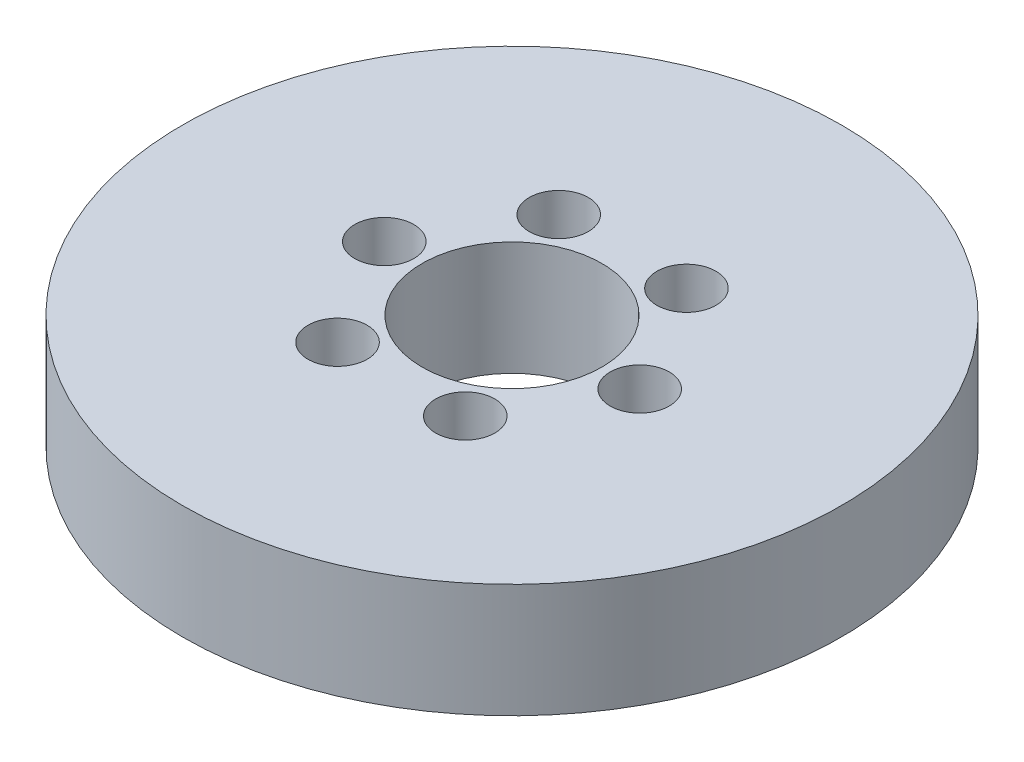
ISO-10303-21;
HEADER;
FILE_DESCRIPTION(('STEP AP214'),'2;1');
FILE_NAME('part.step','',(''),(''),'','','');
FILE_SCHEMA(('AUTOMOTIVE_DESIGN { 1 0 10303 214 1 1 1 1 }'));
ENDSEC;
DATA;
#1=APPLICATION_CONTEXT('core data for automotive mechanical design processes');
#2=APPLICATION_PROTOCOL_DEFINITION('international standard','automotive_design',2000,#1);
#3=PRODUCT_CONTEXT('',#1,'mechanical');
#4=PRODUCT('Part','Part','',(#3));
#5=PRODUCT_RELATED_PRODUCT_CATEGORY('part','',(#4));
#6=PRODUCT_DEFINITION_FORMATION('','',#4);
#7=PRODUCT_DEFINITION_CONTEXT('part definition',#1,'design');
#8=PRODUCT_DEFINITION('design','',#6,#7);
#9=PRODUCT_DEFINITION_SHAPE('','',#8);
#10=(LENGTH_UNIT() NAMED_UNIT(*) SI_UNIT(.MILLI.,.METRE.));
#11=(NAMED_UNIT(*) PLANE_ANGLE_UNIT() SI_UNIT($,.RADIAN.));
#12=(NAMED_UNIT(*) SI_UNIT($,.STERADIAN.) SOLID_ANGLE_UNIT());
#13=UNCERTAINTY_MEASURE_WITH_UNIT(LENGTH_MEASURE(1.E-05),#10,'distance_accuracy_value','');
#14=(GEOMETRIC_REPRESENTATION_CONTEXT(3) GLOBAL_UNCERTAINTY_ASSIGNED_CONTEXT((#13)) GLOBAL_UNIT_ASSIGNED_CONTEXT((#10,
#11,#12)) REPRESENTATION_CONTEXT('',''));
#15=CARTESIAN_POINT('',(0.,0.,0.));
#16=DIRECTION('',(0.,0.,1.));
#17=DIRECTION('',(1.,0.,0.));
#18=AXIS2_PLACEMENT_3D('',#15,#16,#17);
#19=CARTESIAN_POINT('',(0.,19.,0.));
#20=DIRECTION('',(0.,-1.,0.));
#21=DIRECTION('',(0.,0.,-1.));
#22=AXIS2_PLACEMENT_3D('',#19,#20,#21);
#23=CYLINDRICAL_SURFACE('',#22,55.);
#24=CARTESIAN_POINT('',(0.,19.,0.));
#25=DIRECTION('',(0.,1.,0.));
#26=DIRECTION('',(0.,0.,1.));
#27=AXIS2_PLACEMENT_3D('',#24,#25,#26);
#28=CIRCLE('',#27,55.);
#29=CARTESIAN_POINT('',(0.,19.,55.));
#30=VERTEX_POINT('',#29);
#31=EDGE_CURVE('E10',#30,#30,#28,.T.);
#32=ORIENTED_EDGE('',*,*,#31,.F.);
#33=EDGE_LOOP('',(#32));
#34=FACE_BOUND('',#33,.T.);
#35=CARTESIAN_POINT('',(0.,0.,0.));
#36=DIRECTION('',(0.,1.,0.));
#37=DIRECTION('',(0.,0.,1.));
#38=AXIS2_PLACEMENT_3D('',#35,#36,#37);
#39=CIRCLE('',#38,55.);
#40=CARTESIAN_POINT('',(0.,0.,55.));
#41=VERTEX_POINT('',#40);
#42=EDGE_CURVE('E37',#41,#41,#39,.T.);
#43=ORIENTED_EDGE('',*,*,#42,.T.);
#44=EDGE_LOOP('',(#43));
#45=FACE_BOUND('',#44,.T.);
#46=ADVANCED_FACE('F40',(#34,#45),#23,.T.);
#47=CARTESIAN_POINT('',(0.,19.,0.));
#48=DIRECTION('',(0.,1.,0.));
#49=DIRECTION('',(0.,0.,1.));
#50=AXIS2_PLACEMENT_3D('',#47,#48,#49);
#51=PLANE('',#50);
#52=CARTESIAN_POINT('',(-10.6566107133255,19.,-18.4577911919621));
#53=DIRECTION('',(0.,1.,0.));
#54=DIRECTION('',(-0.866025403784433,0.,0.50000000000001));
#55=AXIS2_PLACEMENT_3D('',#52,#53,#54);
#56=CIRCLE('',#55,4.93406653050951);
#57=CARTESIAN_POINT('',(-14.9296376727093,19.,-15.9907579267073));
#58=VERTEX_POINT('',#57);
#59=EDGE_CURVE('E70',#58,#58,#56,.T.);
#60=ORIENTED_EDGE('',*,*,#59,.F.);
#61=EDGE_LOOP('',(#60));
#62=FACE_BOUND('',#61,.T.);
#63=CARTESIAN_POINT('',(10.6566107133251,19.,-18.4577911919623));
#64=DIRECTION('',(0.,1.,0.));
#65=DIRECTION('',(-0.866025403784443,0.,-0.499999999999992));
#66=AXIS2_PLACEMENT_3D('',#63,#64,#65);
#67=CIRCLE('',#66,4.93406653050951);
#68=CARTESIAN_POINT('',(6.38358375394133,19.,-20.924824457217));
#69=VERTEX_POINT('',#68);
#70=EDGE_CURVE('E71',#69,#69,#67,.T.);
#71=ORIENTED_EDGE('',*,*,#70,.F.);
#72=EDGE_LOOP('',(#71));
#73=FACE_BOUND('',#72,.T.);
#74=CARTESIAN_POINT('',(21.3132214266506,19.,0.));
#75=DIRECTION('',(0.,1.,0.));
#76=DIRECTION('',(0.,0.,-1.));
#77=AXIS2_PLACEMENT_3D('',#74,#75,#76);
#78=CIRCLE('',#77,4.93406653050951);
#79=CARTESIAN_POINT('',(21.3132214266506,19.,-4.93406653050951));
#80=VERTEX_POINT('',#79);
#81=EDGE_CURVE('E78',#80,#80,#78,.T.);
#82=ORIENTED_EDGE('',*,*,#81,.F.);
#83=EDGE_LOOP('',(#82));
#84=FACE_BOUND('',#83,.T.);
#85=CARTESIAN_POINT('',(10.6566107133254,19.,18.4577911919622));
#86=DIRECTION('',(0.,1.,0.));
#87=DIRECTION('',(0.866025403784436,0.,-0.500000000000004));
#88=AXIS2_PLACEMENT_3D('',#85,#86,#87);
#89=CIRCLE('',#88,4.93406653050951);
#90=CARTESIAN_POINT('',(14.9296376727092,19.,15.9907579267074));
#91=VERTEX_POINT('',#90);
#92=EDGE_CURVE('E84',#91,#91,#89,.T.);
#93=ORIENTED_EDGE('',*,*,#92,.F.);
#94=EDGE_LOOP('',(#93));
#95=FACE_BOUND('',#94,.T.);
#96=CARTESIAN_POINT('',(-10.6566107133253,19.,18.4577911919623));
#97=DIRECTION('',(0.,1.,0.));
#98=DIRECTION('',(0.86602540378444,0.,0.499999999999998));
#99=AXIS2_PLACEMENT_3D('',#96,#97,#98);
#100=CIRCLE('',#99,4.93406653050951);
#101=CARTESIAN_POINT('',(-6.38358375394147,19.,20.924824457217));
#102=VERTEX_POINT('',#101);
#103=EDGE_CURVE('E61',#102,#102,#100,.T.);
#104=ORIENTED_EDGE('',*,*,#103,.F.);
#105=EDGE_LOOP('',(#104));
#106=FACE_BOUND('',#105,.T.);
#107=CARTESIAN_POINT('',(-21.3132214266506,19.,0.));
#108=DIRECTION('',(0.,1.,0.));
#109=DIRECTION('',(0.,0.,1.));
#110=AXIS2_PLACEMENT_3D('',#107,#108,#109);
#111=CIRCLE('',#110,4.93406653050951);
#112=CARTESIAN_POINT('',(-21.3132214266506,19.,4.93406653050951));
#113=VERTEX_POINT('',#112);
#114=EDGE_CURVE('E54',#113,#113,#111,.T.);
#115=ORIENTED_EDGE('',*,*,#114,.F.);
#116=EDGE_LOOP('',(#115));
#117=FACE_BOUND('',#116,.T.);
#118=CARTESIAN_POINT('',(0.,19.,0.));
#119=DIRECTION('',(0.,1.,0.));
#120=DIRECTION('',(0.,0.,1.));
#121=AXIS2_PLACEMENT_3D('',#118,#119,#120);
#122=CIRCLE('',#121,15.);
#123=CARTESIAN_POINT('',(0.,19.,15.));
#124=VERTEX_POINT('',#123);
#125=EDGE_CURVE('E50',#124,#124,#122,.T.);
#126=ORIENTED_EDGE('',*,*,#125,.F.);
#127=EDGE_LOOP('',(#126));
#128=FACE_BOUND('',#127,.T.);
#129=ORIENTED_EDGE('',*,*,#31,.T.);
#130=EDGE_LOOP('',(#129));
#131=FACE_BOUND('',#130,.T.);
#132=ADVANCED_FACE('F99',(#62,#73,#84,#95,#106,#117,#128,#131),#51,.T.);
#133=CARTESIAN_POINT('',(0.,0.,0.));
#134=DIRECTION('',(0.,1.,0.));
#135=DIRECTION('',(0.,0.,1.));
#136=AXIS2_PLACEMENT_3D('',#133,#134,#135);
#137=PLANE('',#136);
#138=CARTESIAN_POINT('',(0.,0.,0.));
#139=DIRECTION('',(0.,1.,0.));
#140=DIRECTION('',(0.,0.,1.));
#141=AXIS2_PLACEMENT_3D('',#138,#139,#140);
#142=CIRCLE('',#141,15.);
#143=CARTESIAN_POINT('',(0.,0.,15.));
#144=VERTEX_POINT('',#143);
#145=EDGE_CURVE('E47',#144,#144,#142,.T.);
#146=ORIENTED_EDGE('',*,*,#145,.T.);
#147=EDGE_LOOP('',(#146));
#148=FACE_BOUND('',#147,.T.);
#149=ORIENTED_EDGE('',*,*,#42,.F.);
#150=EDGE_LOOP('',(#149));
#151=FACE_BOUND('',#150,.T.);
#152=ADVANCED_FACE('F103',(#148,#151),#137,.F.);
#153=CARTESIAN_POINT('',(0.,19.,0.));
#154=DIRECTION('',(0.,-1.,0.));
#155=DIRECTION('',(0.,0.,-1.));
#156=AXIS2_PLACEMENT_3D('',#153,#154,#155);
#157=CYLINDRICAL_SURFACE('',#156,15.);
#158=ORIENTED_EDGE('',*,*,#125,.T.);
#159=EDGE_LOOP('',(#158));
#160=FACE_BOUND('',#159,.T.);
#161=ORIENTED_EDGE('',*,*,#145,.F.);
#162=EDGE_LOOP('',(#161));
#163=FACE_BOUND('',#162,.T.);
#164=ADVANCED_FACE('F115',(#160,#163),#157,.F.);
#165=CARTESIAN_POINT('',(-21.3132214266506,2.79955285958976,0.));
#166=DIRECTION('',(0.,1.,0.));
#167=DIRECTION('',(0.,0.,1.));
#168=AXIS2_PLACEMENT_3D('',#165,#166,#167);
#169=CYLINDRICAL_SURFACE('',#168,4.93406653050951);
#170=CARTESIAN_POINT('',(-21.3132214266506,2.79955285958976,0.));
#171=DIRECTION('',(0.,1.,0.));
#172=DIRECTION('',(0.,0.,1.));
#173=AXIS2_PLACEMENT_3D('',#170,#171,#172);
#174=CIRCLE('',#173,4.93406653050951);
#175=CARTESIAN_POINT('',(-21.3132214266506,2.79955285958976,4.93406653050951));
#176=VERTEX_POINT('',#175);
#177=EDGE_CURVE('E55',#176,#176,#174,.T.);
#178=ORIENTED_EDGE('',*,*,#177,.F.);
#179=EDGE_LOOP('',(#178));
#180=FACE_BOUND('',#179,.T.);
#181=ORIENTED_EDGE('',*,*,#114,.T.);
#182=EDGE_LOOP('',(#181));
#183=FACE_BOUND('',#182,.T.);
#184=ADVANCED_FACE('F113',(#180,#183),#169,.F.);
#185=CARTESIAN_POINT('',(-21.3132214266506,2.79955285958976,0.));
#186=DIRECTION('',(0.,1.,0.));
#187=DIRECTION('',(0.,0.,1.));
#188=AXIS2_PLACEMENT_3D('',#185,#186,#187);
#189=PLANE('',#188);
#190=ORIENTED_EDGE('',*,*,#177,.T.);
#191=EDGE_LOOP('',(#190));
#192=FACE_BOUND('',#191,.T.);
#193=ADVANCED_FACE('F144',(#192),#189,.T.);
#194=CARTESIAN_POINT('',(-10.6566107133253,2.79955285958976,18.4577911919623));
#195=DIRECTION('',(0.,1.,0.));
#196=DIRECTION('',(0.,0.,1.));
#197=AXIS2_PLACEMENT_3D('',#194,#195,#196);
#198=CYLINDRICAL_SURFACE('',#197,4.93406653050951);
#199=CARTESIAN_POINT('',(-10.6566107133253,2.79955285958976,18.4577911919623));
#200=DIRECTION('',(0.,1.,0.));
#201=DIRECTION('',(0.86602540378444,0.,0.499999999999998));
#202=AXIS2_PLACEMENT_3D('',#199,#200,#201);
#203=CIRCLE('',#202,4.93406653050951);
#204=CARTESIAN_POINT('',(-6.38358375394147,2.79955285958976,20.924824457217));
#205=VERTEX_POINT('',#204);
#206=EDGE_CURVE('E59',#205,#205,#203,.T.);
#207=ORIENTED_EDGE('',*,*,#206,.F.);
#208=EDGE_LOOP('',(#207));
#209=FACE_BOUND('',#208,.T.);
#210=ORIENTED_EDGE('',*,*,#103,.T.);
#211=EDGE_LOOP('',(#210));
#212=FACE_BOUND('',#211,.T.);
#213=ADVANCED_FACE('F153',(#209,#212),#198,.F.);
#214=CARTESIAN_POINT('',(-10.6566107133253,2.79955285958976,18.4577911919623));
#215=DIRECTION('',(0.,1.,0.));
#216=DIRECTION('',(0.86602540378444,0.,0.499999999999998));
#217=AXIS2_PLACEMENT_3D('',#214,#215,#216);
#218=PLANE('',#217);
#219=ORIENTED_EDGE('',*,*,#206,.T.);
#220=EDGE_LOOP('',(#219));
#221=FACE_BOUND('',#220,.T.);
#222=ADVANCED_FACE('F96',(#221),#218,.T.);
#223=CARTESIAN_POINT('',(10.6566107133254,2.79955285958976,18.4577911919622));
#224=DIRECTION('',(0.,1.,0.));
#225=DIRECTION('',(0.,0.,1.));
#226=AXIS2_PLACEMENT_3D('',#223,#224,#225);
#227=CYLINDRICAL_SURFACE('',#226,4.93406653050951);
#228=CARTESIAN_POINT('',(10.6566107133254,2.79955285958976,18.4577911919622));
#229=DIRECTION('',(0.,1.,0.));
#230=DIRECTION('',(0.866025403784436,0.,-0.500000000000004));
#231=AXIS2_PLACEMENT_3D('',#228,#229,#230);
#232=CIRCLE('',#231,4.93406653050951);
#233=CARTESIAN_POINT('',(14.9296376727092,2.79955285958976,15.9907579267074));
#234=VERTEX_POINT('',#233);
#235=EDGE_CURVE('E63',#234,#234,#232,.T.);
#236=ORIENTED_EDGE('',*,*,#235,.F.);
#237=EDGE_LOOP('',(#236));
#238=FACE_BOUND('',#237,.T.);
#239=ORIENTED_EDGE('',*,*,#92,.T.);
#240=EDGE_LOOP('',(#239));
#241=FACE_BOUND('',#240,.T.);
#242=ADVANCED_FACE('F91',(#238,#241),#227,.F.);
#243=CARTESIAN_POINT('',(10.6566107133254,2.79955285958976,18.4577911919622));
#244=DIRECTION('',(0.,1.,0.));
#245=DIRECTION('',(0.866025403784436,0.,-0.500000000000004));
#246=AXIS2_PLACEMENT_3D('',#243,#244,#245);
#247=PLANE('',#246);
#248=ORIENTED_EDGE('',*,*,#235,.T.);
#249=EDGE_LOOP('',(#248));
#250=FACE_BOUND('',#249,.T.);
#251=ADVANCED_FACE('F93',(#250),#247,.T.);
#252=CARTESIAN_POINT('',(21.3132214266506,2.79955285958976,0.));
#253=DIRECTION('',(0.,1.,0.));
#254=DIRECTION('',(0.,0.,1.));
#255=AXIS2_PLACEMENT_3D('',#252,#253,#254);
#256=CYLINDRICAL_SURFACE('',#255,4.93406653050951);
#257=CARTESIAN_POINT('',(21.3132214266506,2.79955285958976,0.));
#258=DIRECTION('',(0.,1.,0.));
#259=DIRECTION('',(0.,0.,-1.));
#260=AXIS2_PLACEMENT_3D('',#257,#258,#259);
#261=CIRCLE('',#260,4.93406653050951);
#262=CARTESIAN_POINT('',(21.3132214266506,2.79955285958976,-4.93406653050951));
#263=VERTEX_POINT('',#262);
#264=EDGE_CURVE('E85',#263,#263,#261,.T.);
#265=ORIENTED_EDGE('',*,*,#264,.F.);
#266=EDGE_LOOP('',(#265));
#267=FACE_BOUND('',#266,.T.);
#268=ORIENTED_EDGE('',*,*,#81,.T.);
#269=EDGE_LOOP('',(#268));
#270=FACE_BOUND('',#269,.T.);
#271=ADVANCED_FACE('F187',(#267,#270),#256,.F.);
#272=CARTESIAN_POINT('',(21.3132214266506,2.79955285958976,0.));
#273=DIRECTION('',(0.,1.,0.));
#274=DIRECTION('',(0.,0.,-1.));
#275=AXIS2_PLACEMENT_3D('',#272,#273,#274);
#276=PLANE('',#275);
#277=ORIENTED_EDGE('',*,*,#264,.T.);
#278=EDGE_LOOP('',(#277));
#279=FACE_BOUND('',#278,.T.);
#280=ADVANCED_FACE('F198',(#279),#276,.T.);
#281=CARTESIAN_POINT('',(10.6566107133251,2.79955285958976,-18.4577911919623));
#282=DIRECTION('',(0.,1.,0.));
#283=DIRECTION('',(0.,0.,1.));
#284=AXIS2_PLACEMENT_3D('',#281,#282,#283);
#285=CYLINDRICAL_SURFACE('',#284,4.93406653050951);
#286=CARTESIAN_POINT('',(10.6566107133251,2.79955285958976,-18.4577911919623));
#287=DIRECTION('',(0.,1.,0.));
#288=DIRECTION('',(-0.866025403784443,0.,-0.499999999999992));
#289=AXIS2_PLACEMENT_3D('',#286,#287,#288);
#290=CIRCLE('',#289,4.93406653050951);
#291=CARTESIAN_POINT('',(6.38358375394133,2.79955285958976,-20.924824457217));
#292=VERTEX_POINT('',#291);
#293=EDGE_CURVE('E76',#292,#292,#290,.T.);
#294=ORIENTED_EDGE('',*,*,#293,.F.);
#295=EDGE_LOOP('',(#294));
#296=FACE_BOUND('',#295,.T.);
#297=ORIENTED_EDGE('',*,*,#70,.T.);
#298=EDGE_LOOP('',(#297));
#299=FACE_BOUND('',#298,.T.);
#300=ADVANCED_FACE('F202',(#296,#299),#285,.F.);
#301=CARTESIAN_POINT('',(10.6566107133251,2.79955285958976,-18.4577911919623));
#302=DIRECTION('',(0.,1.,0.));
#303=DIRECTION('',(-0.866025403784443,0.,-0.499999999999992));
#304=AXIS2_PLACEMENT_3D('',#301,#302,#303);
#305=PLANE('',#304);
#306=ORIENTED_EDGE('',*,*,#293,.T.);
#307=EDGE_LOOP('',(#306));
#308=FACE_BOUND('',#307,.T.);
#309=ADVANCED_FACE('F212',(#308),#305,.T.);
#310=CARTESIAN_POINT('',(-10.6566107133255,2.79955285958976,-18.4577911919621));
#311=DIRECTION('',(0.,1.,0.));
#312=DIRECTION('',(0.,0.,1.));
#313=AXIS2_PLACEMENT_3D('',#310,#311,#312);
#314=CYLINDRICAL_SURFACE('',#313,4.93406653050951);
#315=CARTESIAN_POINT('',(-10.6566107133255,2.79955285958976,-18.4577911919621));
#316=DIRECTION('',(0.,1.,0.));
#317=DIRECTION('',(-0.866025403784433,0.,0.50000000000001));
#318=AXIS2_PLACEMENT_3D('',#315,#316,#317);
#319=CIRCLE('',#318,4.93406653050951);
#320=CARTESIAN_POINT('',(-14.9296376727093,2.79955285958976,-15.9907579267073));
#321=VERTEX_POINT('',#320);
#322=EDGE_CURVE('E69',#321,#321,#319,.T.);
#323=ORIENTED_EDGE('',*,*,#322,.F.);
#324=EDGE_LOOP('',(#323));
#325=FACE_BOUND('',#324,.T.);
#326=ORIENTED_EDGE('',*,*,#59,.T.);
#327=EDGE_LOOP('',(#326));
#328=FACE_BOUND('',#327,.T.);
#329=ADVANCED_FACE('F224',(#325,#328),#314,.F.);
#330=CARTESIAN_POINT('',(-10.6566107133255,2.79955285958976,-18.4577911919621));
#331=DIRECTION('',(0.,1.,0.));
#332=DIRECTION('',(-0.866025403784433,0.,0.50000000000001));
#333=AXIS2_PLACEMENT_3D('',#330,#331,#332);
#334=PLANE('',#333);
#335=ORIENTED_EDGE('',*,*,#322,.T.);
#336=EDGE_LOOP('',(#335));
#337=FACE_BOUND('',#336,.T.);
#338=ADVANCED_FACE('F235',(#337),#334,.T.);
#339=CLOSED_SHELL('',(#46,#132,#152,#164,#184,#193,#213,#222,#242,#251,#271,#280,#300,#309,#329,#338));
#340=MANIFOLD_SOLID_BREP('B2',#339);
#341=ADVANCED_BREP_SHAPE_REPRESENTATION('',(#18,#340),#14);
#342=SHAPE_DEFINITION_REPRESENTATION(#9,#341);
ENDSEC;
END-ISO-10303-21;
